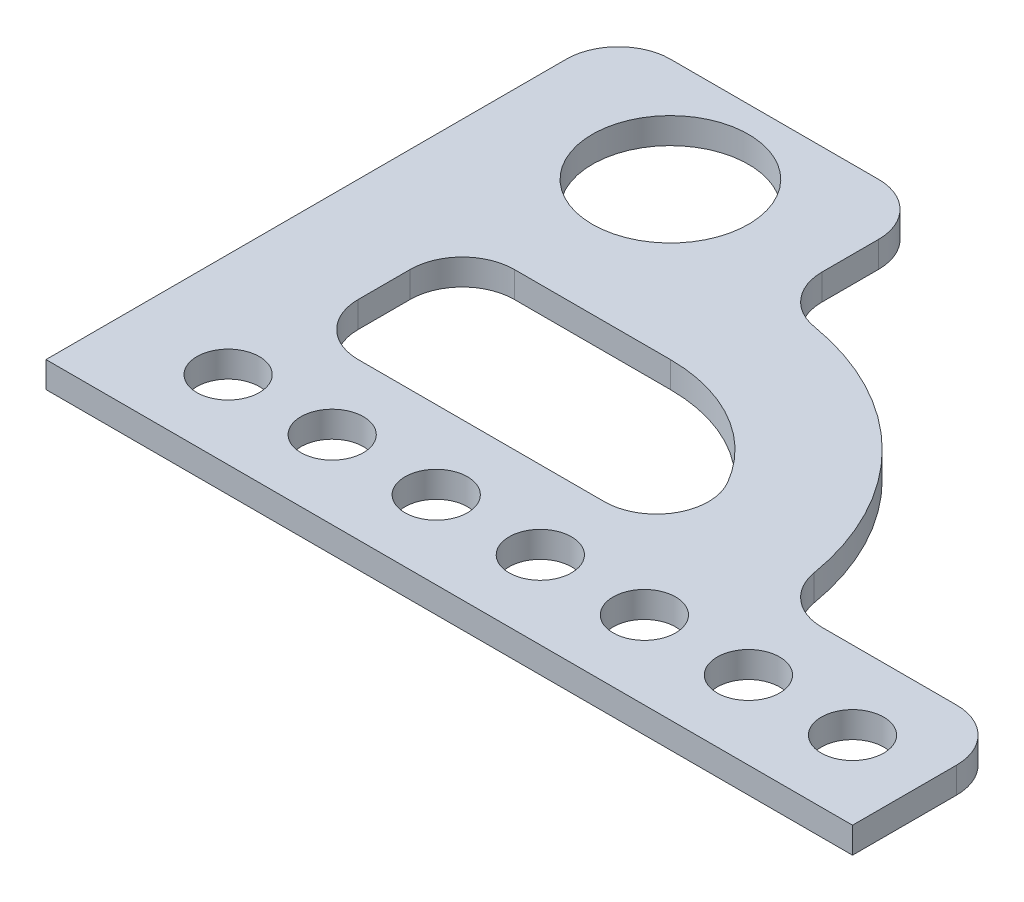
ISO-10303-21;
HEADER;
FILE_DESCRIPTION(('STEP AP214'),'2;1');
FILE_NAME('part.step','',(''),(''),'','','');
FILE_SCHEMA(('AUTOMOTIVE_DESIGN { 1 0 10303 214 1 1 1 1 }'));
ENDSEC;
DATA;
#1=APPLICATION_CONTEXT('core data for automotive mechanical design processes');
#2=APPLICATION_PROTOCOL_DEFINITION('international standard','automotive_design',2000,#1);
#3=PRODUCT_CONTEXT('',#1,'mechanical');
#4=PRODUCT('Part','Part','',(#3));
#5=PRODUCT_RELATED_PRODUCT_CATEGORY('part','',(#4));
#6=PRODUCT_DEFINITION_FORMATION('','',#4);
#7=PRODUCT_DEFINITION_CONTEXT('part definition',#1,'design');
#8=PRODUCT_DEFINITION('design','',#6,#7);
#9=PRODUCT_DEFINITION_SHAPE('','',#8);
#10=(LENGTH_UNIT() NAMED_UNIT(*) SI_UNIT(.MILLI.,.METRE.));
#11=(NAMED_UNIT(*) PLANE_ANGLE_UNIT() SI_UNIT($,.RADIAN.));
#12=(NAMED_UNIT(*) SI_UNIT($,.STERADIAN.) SOLID_ANGLE_UNIT());
#13=UNCERTAINTY_MEASURE_WITH_UNIT(LENGTH_MEASURE(1.E-05),#10,'distance_accuracy_value','');
#14=(GEOMETRIC_REPRESENTATION_CONTEXT(3) GLOBAL_UNCERTAINTY_ASSIGNED_CONTEXT((#13)) GLOBAL_UNIT_ASSIGNED_CONTEXT((#10,
#11,#12)) REPRESENTATION_CONTEXT('',''));
#15=CARTESIAN_POINT('',(0.,0.,0.));
#16=DIRECTION('',(0.,0.,1.));
#17=DIRECTION('',(1.,0.,0.));
#18=AXIS2_PLACEMENT_3D('',#15,#16,#17);
#19=CARTESIAN_POINT('',(10.,5.,-100.));
#20=DIRECTION('',(0.,1.,0.));
#21=DIRECTION('',(0.,0.,1.));
#22=AXIS2_PLACEMENT_3D('',#19,#20,#21);
#23=PLANE('',#22);
#24=CARTESIAN_POINT('',(140.,5.,-15.));
#25=DIRECTION('',(0.,1.,0.));
#26=DIRECTION('',(0.,0.,1.));
#27=AXIS2_PLACEMENT_3D('',#24,#25,#26);
#28=CIRCLE('',#27,6.00000000000002);
#29=CARTESIAN_POINT('',(140.,5.,-8.99999999999998));
#30=VERTEX_POINT('',#29);
#31=EDGE_CURVE('E258',#30,#30,#28,.T.);
#32=ORIENTED_EDGE('',*,*,#31,.F.);
#33=EDGE_LOOP('',(#32));
#34=FACE_BOUND('',#33,.T.);
#35=CARTESIAN_POINT('',(100.,5.,-15.));
#36=DIRECTION('',(0.,1.,0.));
#37=DIRECTION('',(0.,0.,1.));
#38=AXIS2_PLACEMENT_3D('',#35,#36,#37);
#39=CIRCLE('',#38,6.);
#40=CARTESIAN_POINT('',(100.,5.,-9.));
#41=VERTEX_POINT('',#40);
#42=EDGE_CURVE('E274',#41,#41,#39,.T.);
#43=ORIENTED_EDGE('',*,*,#42,.F.);
#44=EDGE_LOOP('',(#43));
#45=FACE_BOUND('',#44,.T.);
#46=CARTESIAN_POINT('',(60.,5.,-15.));
#47=DIRECTION('',(0.,1.,0.));
#48=DIRECTION('',(0.,0.,1.));
#49=AXIS2_PLACEMENT_3D('',#46,#47,#48);
#50=CIRCLE('',#49,5.99999999999999);
#51=CARTESIAN_POINT('',(60.,5.,-9.00000000000001));
#52=VERTEX_POINT('',#51);
#53=EDGE_CURVE('E290',#52,#52,#50,.T.);
#54=ORIENTED_EDGE('',*,*,#53,.F.);
#55=EDGE_LOOP('',(#54));
#56=FACE_BOUND('',#55,.T.);
#57=CARTESIAN_POINT('',(20.,5.,-15.));
#58=DIRECTION('',(0.,1.,0.));
#59=DIRECTION('',(0.,0.,1.));
#60=AXIS2_PLACEMENT_3D('',#57,#58,#59);
#61=CIRCLE('',#60,6.);
#62=CARTESIAN_POINT('',(20.,5.,-9.));
#63=VERTEX_POINT('',#62);
#64=EDGE_CURVE('E306',#63,#63,#61,.T.);
#65=ORIENTED_EDGE('',*,*,#64,.F.);
#66=EDGE_LOOP('',(#65));
#67=FACE_BOUND('',#66,.T.);
#68=DIRECTION('',(0.,0.,1.));
#69=VECTOR('',#68,1.);
#70=CARTESIAN_POINT('',(0.,5.,0.));
#71=LINE('',#70,#69);
#72=CARTESIAN_POINT('',(0.,5.,-99.9999999999999));
#73=VERTEX_POINT('',#72);
#74=CARTESIAN_POINT('',(0.,5.,0.));
#75=VERTEX_POINT('',#74);
#76=EDGE_CURVE('E314',#73,#75,#71,.T.);
#77=ORIENTED_EDGE('',*,*,#76,.T.);
#78=DIRECTION('',(1.,0.,0.));
#79=VECTOR('',#78,1.);
#80=CARTESIAN_POINT('',(0.,5.,0.));
#81=LINE('',#80,#79);
#82=CARTESIAN_POINT('',(155.,5.,0.));
#83=VERTEX_POINT('',#82);
#84=EDGE_CURVE('E318',#75,#83,#81,.T.);
#85=ORIENTED_EDGE('',*,*,#84,.T.);
#86=DIRECTION('',(0.,0.,-1.));
#87=VECTOR('',#86,1.);
#88=CARTESIAN_POINT('',(155.,5.,0.));
#89=LINE('',#88,#87);
#90=CARTESIAN_POINT('',(155.,5.,-19.9999999999999));
#91=VERTEX_POINT('',#90);
#92=EDGE_CURVE('E322',#83,#91,#89,.T.);
#93=ORIENTED_EDGE('',*,*,#92,.T.);
#94=CARTESIAN_POINT('',(145.,5.,-20.));
#95=DIRECTION('',(0.,1.,0.));
#96=DIRECTION('',(0.,0.,1.));
#97=AXIS2_PLACEMENT_3D('',#94,#95,#96);
#98=CIRCLE('',#97,10.);
#99=CARTESIAN_POINT('',(145.,5.,-30.));
#100=VERTEX_POINT('',#99);
#101=EDGE_CURVE('E325',#91,#100,#98,.T.);
#102=ORIENTED_EDGE('',*,*,#101,.T.);
#103=DIRECTION('',(-1.,0.,0.));
#104=VECTOR('',#103,1.);
#105=CARTESIAN_POINT('',(145.,5.,-30.));
#106=LINE('',#105,#104);
#107=CARTESIAN_POINT('',(119.160797830996,5.,-30.));
#108=VERTEX_POINT('',#107);
#109=EDGE_CURVE('E328',#100,#108,#106,.T.);
#110=ORIENTED_EDGE('',*,*,#109,.T.);
#111=CARTESIAN_POINT('',(119.160797830996,5.,-40.));
#112=DIRECTION('',(0.,-1.,0.));
#113=DIRECTION('',(0.,0.,-1.));
#114=AXIS2_PLACEMENT_3D('',#111,#112,#113);
#115=CIRCLE('',#114,10.);
#116=CARTESIAN_POINT('',(109.300664859163,5.,-38.3333333333333));
#117=VERTEX_POINT('',#116);
#118=EDGE_CURVE('E331',#108,#117,#115,.T.);
#119=ORIENTED_EDGE('',*,*,#118,.T.);
#120=CARTESIAN_POINT('',(60.,5.,-30.));
#121=DIRECTION('',(0.,1.,0.));
#122=DIRECTION('',(0.,0.,1.));
#123=AXIS2_PLACEMENT_3D('',#120,#121,#122);
#124=CIRCLE('',#123,50.);
#125=CARTESIAN_POINT('',(68.3333333333333,5.,-79.3006648591635));
#126=VERTEX_POINT('',#125);
#127=EDGE_CURVE('E334',#117,#126,#124,.T.);
#128=ORIENTED_EDGE('',*,*,#127,.T.);
#129=CARTESIAN_POINT('',(70.,5.,-89.1607978309962));
#130=DIRECTION('',(0.,-1.,0.));
#131=DIRECTION('',(0.,0.,-1.));
#132=AXIS2_PLACEMENT_3D('',#129,#130,#131);
#133=CIRCLE('',#132,10.);
#134=CARTESIAN_POINT('',(60.,5.,-89.1607978309962));
#135=VERTEX_POINT('',#134);
#136=EDGE_CURVE('E337',#126,#135,#133,.T.);
#137=ORIENTED_EDGE('',*,*,#136,.T.);
#138=DIRECTION('',(0.,0.,-1.));
#139=VECTOR('',#138,1.);
#140=CARTESIAN_POINT('',(60.,5.,-99.9999999999999));
#141=LINE('',#140,#139);
#142=CARTESIAN_POINT('',(60.,5.,-99.9999999999999));
#143=VERTEX_POINT('',#142);
#144=EDGE_CURVE('E340',#135,#143,#141,.T.);
#145=ORIENTED_EDGE('',*,*,#144,.T.);
#146=CARTESIAN_POINT('',(50.,5.,-100.));
#147=DIRECTION('',(0.,1.,0.));
#148=DIRECTION('',(0.,0.,1.));
#149=AXIS2_PLACEMENT_3D('',#146,#147,#148);
#150=CIRCLE('',#149,9.99999999999999);
#151=CARTESIAN_POINT('',(49.9999999999999,5.,-110.));
#152=VERTEX_POINT('',#151);
#153=EDGE_CURVE('E343',#143,#152,#150,.T.);
#154=ORIENTED_EDGE('',*,*,#153,.T.);
#155=DIRECTION('',(-1.,0.,0.));
#156=VECTOR('',#155,1.);
#157=CARTESIAN_POINT('',(10.0000000000001,5.,-110.));
#158=LINE('',#157,#156);
#159=CARTESIAN_POINT('',(10.0000000000001,5.,-110.));
#160=VERTEX_POINT('',#159);
#161=EDGE_CURVE('E346',#152,#160,#158,.T.);
#162=ORIENTED_EDGE('',*,*,#161,.T.);
#163=CARTESIAN_POINT('',(10.,5.,-100.));
#164=DIRECTION('',(0.,1.,0.));
#165=DIRECTION('',(0.,0.,1.));
#166=AXIS2_PLACEMENT_3D('',#163,#164,#165);
#167=CIRCLE('',#166,10.);
#168=EDGE_CURVE('E349',#160,#73,#167,.T.);
#169=ORIENTED_EDGE('',*,*,#168,.T.);
#170=EDGE_LOOP('',(#77,#85,#93,#102,#110,#119,#128,#137,#145,#154,#162,#169));
#171=FACE_BOUND('',#170,.T.);
#172=CARTESIAN_POINT('',(40.,5.,-15.));
#173=DIRECTION('',(0.,1.,0.));
#174=DIRECTION('',(0.,0.,1.));
#175=AXIS2_PLACEMENT_3D('',#172,#173,#174);
#176=CIRCLE('',#175,6.);
#177=CARTESIAN_POINT('',(40.,5.,-9.));
#178=VERTEX_POINT('',#177);
#179=EDGE_CURVE('E298',#178,#178,#176,.T.);
#180=ORIENTED_EDGE('',*,*,#179,.F.);
#181=EDGE_LOOP('',(#180));
#182=FACE_BOUND('',#181,.T.);
#183=CARTESIAN_POINT('',(80.,5.,-15.));
#184=DIRECTION('',(0.,1.,0.));
#185=DIRECTION('',(0.,0.,1.));
#186=AXIS2_PLACEMENT_3D('',#183,#184,#185);
#187=CIRCLE('',#186,6.);
#188=CARTESIAN_POINT('',(80.,5.,-9.));
#189=VERTEX_POINT('',#188);
#190=EDGE_CURVE('E282',#189,#189,#187,.T.);
#191=ORIENTED_EDGE('',*,*,#190,.F.);
#192=EDGE_LOOP('',(#191));
#193=FACE_BOUND('',#192,.T.);
#194=CARTESIAN_POINT('',(120.,5.,-15.));
#195=DIRECTION('',(0.,1.,0.));
#196=DIRECTION('',(0.,0.,1.));
#197=AXIS2_PLACEMENT_3D('',#194,#195,#196);
#198=CIRCLE('',#197,6.00000000000002);
#199=CARTESIAN_POINT('',(120.,5.,-8.99999999999998));
#200=VERTEX_POINT('',#199);
#201=EDGE_CURVE('E266',#200,#200,#198,.T.);
#202=ORIENTED_EDGE('',*,*,#201,.F.);
#203=EDGE_LOOP('',(#202));
#204=FACE_BOUND('',#203,.T.);
#205=CARTESIAN_POINT('',(30.,5.,-90.));
#206=DIRECTION('',(0.,1.,0.));
#207=DIRECTION('',(0.,0.,1.));
#208=AXIS2_PLACEMENT_3D('',#205,#206,#207);
#209=CIRCLE('',#208,15.);
#210=CARTESIAN_POINT('',(30.,5.,-75.));
#211=VERTEX_POINT('',#210);
#212=EDGE_CURVE('E250',#211,#211,#209,.T.);
#213=ORIENTED_EDGE('',*,*,#212,.F.);
#214=EDGE_LOOP('',(#213));
#215=FACE_BOUND('',#214,.T.);
#216=DIRECTION('',(0.,0.,1.));
#217=VECTOR('',#216,1.);
#218=CARTESIAN_POINT('',(20.,5.,-50.));
#219=LINE('',#218,#217);
#220=CARTESIAN_POINT('',(20.,5.,-50.));
#221=VERTEX_POINT('',#220);
#222=CARTESIAN_POINT('',(20.,5.,-40.));
#223=VERTEX_POINT('',#222);
#224=EDGE_CURVE('E180',#221,#223,#219,.T.);
#225=ORIENTED_EDGE('',*,*,#224,.F.);
#226=CARTESIAN_POINT('',(30.,5.,-50.));
#227=DIRECTION('',(0.,1.,0.));
#228=DIRECTION('',(0.,0.,1.));
#229=AXIS2_PLACEMENT_3D('',#226,#227,#228);
#230=CIRCLE('',#229,10.);
#231=CARTESIAN_POINT('',(30.,5.,-60.));
#232=VERTEX_POINT('',#231);
#233=EDGE_CURVE('E171',#232,#221,#230,.T.);
#234=ORIENTED_EDGE('',*,*,#233,.F.);
#235=DIRECTION('',(-1.,0.,0.));
#236=VECTOR('',#235,1.);
#237=CARTESIAN_POINT('',(60.,5.,-60.));
#238=LINE('',#237,#236);
#239=CARTESIAN_POINT('',(60.,5.,-60.));
#240=VERTEX_POINT('',#239);
#241=EDGE_CURVE('E209',#240,#232,#238,.T.);
#242=ORIENTED_EDGE('',*,*,#241,.F.);
#243=CARTESIAN_POINT('',(60.,5.,-30.));
#244=DIRECTION('',(0.,1.,0.));
#245=DIRECTION('',(0.,0.,1.));
#246=AXIS2_PLACEMENT_3D('',#243,#244,#245);
#247=CIRCLE('',#246,30.);
#248=CARTESIAN_POINT('',(85.9807621135332,5.,-45.));
#249=VERTEX_POINT('',#248);
#250=EDGE_CURVE('E206',#249,#240,#247,.T.);
#251=ORIENTED_EDGE('',*,*,#250,.F.);
#252=CARTESIAN_POINT('',(77.3205080756888,5.,-40.));
#253=DIRECTION('',(0.,1.,0.));
#254=DIRECTION('',(0.,0.,1.));
#255=AXIS2_PLACEMENT_3D('',#252,#253,#254);
#256=CIRCLE('',#255,10.);
#257=CARTESIAN_POINT('',(77.3205080756888,5.,-30.));
#258=VERTEX_POINT('',#257);
#259=EDGE_CURVE('E203',#258,#249,#256,.T.);
#260=ORIENTED_EDGE('',*,*,#259,.F.);
#261=DIRECTION('',(1.,0.,0.));
#262=VECTOR('',#261,1.);
#263=CARTESIAN_POINT('',(30.,5.,-30.));
#264=LINE('',#263,#262);
#265=CARTESIAN_POINT('',(30.,5.,-30.));
#266=VERTEX_POINT('',#265);
#267=EDGE_CURVE('E198',#266,#258,#264,.T.);
#268=ORIENTED_EDGE('',*,*,#267,.F.);
#269=CARTESIAN_POINT('',(30.,5.,-40.));
#270=DIRECTION('',(0.,1.,0.));
#271=DIRECTION('',(0.,0.,-1.));
#272=AXIS2_PLACEMENT_3D('',#269,#270,#271);
#273=CIRCLE('',#272,10.);
#274=EDGE_CURVE('E194',#223,#266,#273,.T.);
#275=ORIENTED_EDGE('',*,*,#274,.F.);
#276=EDGE_LOOP('',(#225,#234,#242,#251,#260,#268,#275));
#277=FACE_BOUND('',#276,.T.);
#278=ADVANCED_FACE('F39',(#34,#45,#56,#67,#171,#182,#193,#204,#215,#277),#23,.T.);
#279=CARTESIAN_POINT('',(10.,0.,-100.));
#280=DIRECTION('',(0.,1.,0.));
#281=DIRECTION('',(0.,0.,1.));
#282=AXIS2_PLACEMENT_3D('',#279,#280,#281);
#283=PLANE('',#282);
#284=CARTESIAN_POINT('',(30.,0.,-90.));
#285=DIRECTION('',(0.,1.,0.));
#286=DIRECTION('',(0.,0.,1.));
#287=AXIS2_PLACEMENT_3D('',#284,#285,#286);
#288=CIRCLE('',#287,15.);
#289=CARTESIAN_POINT('',(30.,0.,-75.));
#290=VERTEX_POINT('',#289);
#291=EDGE_CURVE('E189',#290,#290,#288,.T.);
#292=ORIENTED_EDGE('',*,*,#291,.T.);
#293=EDGE_LOOP('',(#292));
#294=FACE_BOUND('',#293,.T.);
#295=CARTESIAN_POINT('',(140.,0.,-15.));
#296=DIRECTION('',(0.,1.,0.));
#297=DIRECTION('',(0.,0.,1.));
#298=AXIS2_PLACEMENT_3D('',#295,#296,#297);
#299=CIRCLE('',#298,6.00000000000002);
#300=CARTESIAN_POINT('',(140.,0.,-8.99999999999998));
#301=VERTEX_POINT('',#300);
#302=EDGE_CURVE('E254',#301,#301,#299,.T.);
#303=ORIENTED_EDGE('',*,*,#302,.T.);
#304=EDGE_LOOP('',(#303));
#305=FACE_BOUND('',#304,.T.);
#306=CARTESIAN_POINT('',(120.,0.,-15.));
#307=DIRECTION('',(0.,1.,0.));
#308=DIRECTION('',(0.,0.,1.));
#309=AXIS2_PLACEMENT_3D('',#306,#307,#308);
#310=CIRCLE('',#309,6.00000000000002);
#311=CARTESIAN_POINT('',(120.,0.,-8.99999999999998));
#312=VERTEX_POINT('',#311);
#313=EDGE_CURVE('E262',#312,#312,#310,.T.);
#314=ORIENTED_EDGE('',*,*,#313,.T.);
#315=EDGE_LOOP('',(#314));
#316=FACE_BOUND('',#315,.T.);
#317=CARTESIAN_POINT('',(100.,0.,-15.));
#318=DIRECTION('',(0.,1.,0.));
#319=DIRECTION('',(0.,0.,1.));
#320=AXIS2_PLACEMENT_3D('',#317,#318,#319);
#321=CIRCLE('',#320,6.);
#322=CARTESIAN_POINT('',(100.,0.,-9.));
#323=VERTEX_POINT('',#322);
#324=EDGE_CURVE('E270',#323,#323,#321,.T.);
#325=ORIENTED_EDGE('',*,*,#324,.T.);
#326=EDGE_LOOP('',(#325));
#327=FACE_BOUND('',#326,.T.);
#328=CARTESIAN_POINT('',(80.,0.,-15.));
#329=DIRECTION('',(0.,1.,0.));
#330=DIRECTION('',(0.,0.,1.));
#331=AXIS2_PLACEMENT_3D('',#328,#329,#330);
#332=CIRCLE('',#331,6.);
#333=CARTESIAN_POINT('',(80.,0.,-9.));
#334=VERTEX_POINT('',#333);
#335=EDGE_CURVE('E278',#334,#334,#332,.T.);
#336=ORIENTED_EDGE('',*,*,#335,.T.);
#337=EDGE_LOOP('',(#336));
#338=FACE_BOUND('',#337,.T.);
#339=CARTESIAN_POINT('',(60.,0.,-15.));
#340=DIRECTION('',(0.,1.,0.));
#341=DIRECTION('',(0.,0.,1.));
#342=AXIS2_PLACEMENT_3D('',#339,#340,#341);
#343=CIRCLE('',#342,5.99999999999999);
#344=CARTESIAN_POINT('',(60.,0.,-9.00000000000001));
#345=VERTEX_POINT('',#344);
#346=EDGE_CURVE('E286',#345,#345,#343,.T.);
#347=ORIENTED_EDGE('',*,*,#346,.T.);
#348=EDGE_LOOP('',(#347));
#349=FACE_BOUND('',#348,.T.);
#350=CARTESIAN_POINT('',(40.,0.,-15.));
#351=DIRECTION('',(0.,1.,0.));
#352=DIRECTION('',(0.,0.,1.));
#353=AXIS2_PLACEMENT_3D('',#350,#351,#352);
#354=CIRCLE('',#353,6.);
#355=CARTESIAN_POINT('',(40.,0.,-9.));
#356=VERTEX_POINT('',#355);
#357=EDGE_CURVE('E294',#356,#356,#354,.T.);
#358=ORIENTED_EDGE('',*,*,#357,.T.);
#359=EDGE_LOOP('',(#358));
#360=FACE_BOUND('',#359,.T.);
#361=CARTESIAN_POINT('',(20.,0.,-15.));
#362=DIRECTION('',(0.,1.,0.));
#363=DIRECTION('',(0.,0.,1.));
#364=AXIS2_PLACEMENT_3D('',#361,#362,#363);
#365=CIRCLE('',#364,6.);
#366=CARTESIAN_POINT('',(20.,0.,-9.));
#367=VERTEX_POINT('',#366);
#368=EDGE_CURVE('E302',#367,#367,#365,.T.);
#369=ORIENTED_EDGE('',*,*,#368,.T.);
#370=EDGE_LOOP('',(#369));
#371=FACE_BOUND('',#370,.T.);
#372=DIRECTION('',(0.,0.,1.));
#373=VECTOR('',#372,1.);
#374=CARTESIAN_POINT('',(0.,0.,0.));
#375=LINE('',#374,#373);
#376=CARTESIAN_POINT('',(0.,0.,-99.9999999999999));
#377=VERTEX_POINT('',#376);
#378=CARTESIAN_POINT('',(0.,0.,0.));
#379=VERTEX_POINT('',#378);
#380=EDGE_CURVE('E310',#377,#379,#375,.T.);
#381=ORIENTED_EDGE('',*,*,#380,.F.);
#382=CARTESIAN_POINT('',(10.,0.,-100.));
#383=DIRECTION('',(0.,1.,0.));
#384=DIRECTION('',(0.,0.,1.));
#385=AXIS2_PLACEMENT_3D('',#382,#383,#384);
#386=CIRCLE('',#385,10.);
#387=CARTESIAN_POINT('',(10.0000000000001,0.,-110.));
#388=VERTEX_POINT('',#387);
#389=EDGE_CURVE('E319',#388,#377,#386,.T.);
#390=ORIENTED_EDGE('',*,*,#389,.F.);
#391=DIRECTION('',(-1.,0.,0.));
#392=VECTOR('',#391,1.);
#393=CARTESIAN_POINT('',(10.0000000000001,0.,-110.));
#394=LINE('',#393,#392);
#395=CARTESIAN_POINT('',(49.9999999999999,0.,-110.));
#396=VERTEX_POINT('',#395);
#397=EDGE_CURVE('E383',#396,#388,#394,.T.);
#398=ORIENTED_EDGE('',*,*,#397,.F.);
#399=CARTESIAN_POINT('',(50.,0.,-100.));
#400=DIRECTION('',(0.,1.,0.));
#401=DIRECTION('',(0.,0.,1.));
#402=AXIS2_PLACEMENT_3D('',#399,#400,#401);
#403=CIRCLE('',#402,9.99999999999999);
#404=CARTESIAN_POINT('',(60.,0.,-99.9999999999999));
#405=VERTEX_POINT('',#404);
#406=EDGE_CURVE('E380',#405,#396,#403,.T.);
#407=ORIENTED_EDGE('',*,*,#406,.F.);
#408=DIRECTION('',(0.,0.,-1.));
#409=VECTOR('',#408,1.);
#410=CARTESIAN_POINT('',(60.,0.,-99.9999999999999));
#411=LINE('',#410,#409);
#412=CARTESIAN_POINT('',(60.,0.,-89.1607978309962));
#413=VERTEX_POINT('',#412);
#414=EDGE_CURVE('E377',#413,#405,#411,.T.);
#415=ORIENTED_EDGE('',*,*,#414,.F.);
#416=CARTESIAN_POINT('',(70.,0.,-89.1607978309962));
#417=DIRECTION('',(0.,-1.,0.));
#418=DIRECTION('',(0.,0.,-1.));
#419=AXIS2_PLACEMENT_3D('',#416,#417,#418);
#420=CIRCLE('',#419,10.);
#421=CARTESIAN_POINT('',(68.3333333333333,0.,-79.3006648591635));
#422=VERTEX_POINT('',#421);
#423=EDGE_CURVE('E374',#422,#413,#420,.T.);
#424=ORIENTED_EDGE('',*,*,#423,.F.);
#425=CARTESIAN_POINT('',(60.,0.,-30.));
#426=DIRECTION('',(0.,1.,0.));
#427=DIRECTION('',(0.,0.,1.));
#428=AXIS2_PLACEMENT_3D('',#425,#426,#427);
#429=CIRCLE('',#428,50.);
#430=CARTESIAN_POINT('',(109.300664859163,0.,-38.3333333333333));
#431=VERTEX_POINT('',#430);
#432=EDGE_CURVE('E371',#431,#422,#429,.T.);
#433=ORIENTED_EDGE('',*,*,#432,.F.);
#434=CARTESIAN_POINT('',(119.160797830996,0.,-40.));
#435=DIRECTION('',(0.,-1.,0.));
#436=DIRECTION('',(0.,0.,-1.));
#437=AXIS2_PLACEMENT_3D('',#434,#435,#436);
#438=CIRCLE('',#437,10.);
#439=CARTESIAN_POINT('',(119.160797830996,0.,-30.));
#440=VERTEX_POINT('',#439);
#441=EDGE_CURVE('E368',#440,#431,#438,.T.);
#442=ORIENTED_EDGE('',*,*,#441,.F.);
#443=DIRECTION('',(-1.,0.,0.));
#444=VECTOR('',#443,1.);
#445=CARTESIAN_POINT('',(145.,0.,-30.));
#446=LINE('',#445,#444);
#447=CARTESIAN_POINT('',(145.,0.,-30.));
#448=VERTEX_POINT('',#447);
#449=EDGE_CURVE('E365',#448,#440,#446,.T.);
#450=ORIENTED_EDGE('',*,*,#449,.F.);
#451=CARTESIAN_POINT('',(145.,0.,-20.));
#452=DIRECTION('',(0.,1.,0.));
#453=DIRECTION('',(0.,0.,1.));
#454=AXIS2_PLACEMENT_3D('',#451,#452,#453);
#455=CIRCLE('',#454,10.);
#456=CARTESIAN_POINT('',(155.,0.,-19.9999999999999));
#457=VERTEX_POINT('',#456);
#458=EDGE_CURVE('E362',#457,#448,#455,.T.);
#459=ORIENTED_EDGE('',*,*,#458,.F.);
#460=DIRECTION('',(0.,0.,-1.));
#461=VECTOR('',#460,1.);
#462=CARTESIAN_POINT('',(155.,0.,0.));
#463=LINE('',#462,#461);
#464=CARTESIAN_POINT('',(155.,0.,0.));
#465=VERTEX_POINT('',#464);
#466=EDGE_CURVE('E359',#465,#457,#463,.T.);
#467=ORIENTED_EDGE('',*,*,#466,.F.);
#468=DIRECTION('',(1.,0.,0.));
#469=VECTOR('',#468,1.);
#470=CARTESIAN_POINT('',(0.,0.,0.));
#471=LINE('',#470,#469);
#472=EDGE_CURVE('E356',#379,#465,#471,.T.);
#473=ORIENTED_EDGE('',*,*,#472,.F.);
#474=EDGE_LOOP('',(#381,#390,#398,#407,#415,#424,#433,#442,#450,#459,#467,#473));
#475=FACE_BOUND('',#474,.T.);
#476=CARTESIAN_POINT('',(30.,0.,-50.));
#477=DIRECTION('',(0.,1.,0.));
#478=DIRECTION('',(0.,0.,1.));
#479=AXIS2_PLACEMENT_3D('',#476,#477,#478);
#480=CIRCLE('',#479,10.);
#481=CARTESIAN_POINT('',(30.,0.,-60.));
#482=VERTEX_POINT('',#481);
#483=CARTESIAN_POINT('',(20.,0.,-50.));
#484=VERTEX_POINT('',#483);
#485=EDGE_CURVE('E63',#482,#484,#480,.T.);
#486=ORIENTED_EDGE('',*,*,#485,.T.);
#487=DIRECTION('',(0.,0.,1.));
#488=VECTOR('',#487,1.);
#489=CARTESIAN_POINT('',(20.,0.,-50.));
#490=LINE('',#489,#488);
#491=CARTESIAN_POINT('',(20.,0.,-40.));
#492=VERTEX_POINT('',#491);
#493=EDGE_CURVE('E187',#484,#492,#490,.T.);
#494=ORIENTED_EDGE('',*,*,#493,.T.);
#495=CARTESIAN_POINT('',(30.,0.,-40.));
#496=DIRECTION('',(0.,1.,0.));
#497=DIRECTION('',(0.,0.,-1.));
#498=AXIS2_PLACEMENT_3D('',#495,#496,#497);
#499=CIRCLE('',#498,10.);
#500=CARTESIAN_POINT('',(30.,0.,-30.));
#501=VERTEX_POINT('',#500);
#502=EDGE_CURVE('E216',#492,#501,#499,.T.);
#503=ORIENTED_EDGE('',*,*,#502,.T.);
#504=DIRECTION('',(1.,0.,0.));
#505=VECTOR('',#504,1.);
#506=CARTESIAN_POINT('',(30.,0.,-30.));
#507=LINE('',#506,#505);
#508=CARTESIAN_POINT('',(77.3205080756888,0.,-30.));
#509=VERTEX_POINT('',#508);
#510=EDGE_CURVE('E220',#501,#509,#507,.T.);
#511=ORIENTED_EDGE('',*,*,#510,.T.);
#512=CARTESIAN_POINT('',(77.3205080756888,0.,-40.));
#513=DIRECTION('',(0.,1.,0.));
#514=DIRECTION('',(0.,0.,1.));
#515=AXIS2_PLACEMENT_3D('',#512,#513,#514);
#516=CIRCLE('',#515,10.);
#517=CARTESIAN_POINT('',(85.9807621135332,0.,-45.));
#518=VERTEX_POINT('',#517);
#519=EDGE_CURVE('E224',#509,#518,#516,.T.);
#520=ORIENTED_EDGE('',*,*,#519,.T.);
#521=CARTESIAN_POINT('',(60.,0.,-30.));
#522=DIRECTION('',(0.,1.,0.));
#523=DIRECTION('',(0.,0.,1.));
#524=AXIS2_PLACEMENT_3D('',#521,#522,#523);
#525=CIRCLE('',#524,30.);
#526=CARTESIAN_POINT('',(60.,0.,-60.));
#527=VERTEX_POINT('',#526);
#528=EDGE_CURVE('E228',#518,#527,#525,.T.);
#529=ORIENTED_EDGE('',*,*,#528,.T.);
#530=DIRECTION('',(-1.,0.,0.));
#531=VECTOR('',#530,1.);
#532=CARTESIAN_POINT('',(60.,0.,-60.));
#533=LINE('',#532,#531);
#534=EDGE_CURVE('E181',#527,#482,#533,.T.);
#535=ORIENTED_EDGE('',*,*,#534,.T.);
#536=EDGE_LOOP('',(#486,#494,#503,#511,#520,#529,#535));
#537=FACE_BOUND('',#536,.T.);
#538=ADVANCED_FACE('F438',(#294,#305,#316,#327,#338,#349,#360,#371,#475,#537),#283,.F.);
#539=CARTESIAN_POINT('',(0.,5.,0.));
#540=DIRECTION('',(1.,0.,0.));
#541=DIRECTION('',(0.,0.,-1.));
#542=AXIS2_PLACEMENT_3D('',#539,#540,#541);
#543=PLANE('',#542);
#544=ORIENTED_EDGE('',*,*,#380,.T.);
#545=DIRECTION('',(0.,-1.,0.));
#546=VECTOR('',#545,1.);
#547=CARTESIAN_POINT('',(0.,5.,0.));
#548=LINE('',#547,#546);
#549=EDGE_CURVE('E11',#75,#379,#548,.T.);
#550=ORIENTED_EDGE('',*,*,#549,.F.);
#551=ORIENTED_EDGE('',*,*,#76,.F.);
#552=DIRECTION('',(0.,-1.,0.));
#553=VECTOR('',#552,1.);
#554=CARTESIAN_POINT('',(0.,5.,-99.9999999999999));
#555=LINE('',#554,#553);
#556=EDGE_CURVE('E352',#73,#377,#555,.T.);
#557=ORIENTED_EDGE('',*,*,#556,.T.);
#558=EDGE_LOOP('',(#544,#550,#551,#557));
#559=FACE_BOUND('',#558,.T.);
#560=ADVANCED_FACE('F41',(#559),#543,.F.);
#561=CARTESIAN_POINT('',(0.,5.,0.));
#562=DIRECTION('',(0.,0.,-1.));
#563=DIRECTION('',(-1.,0.,0.));
#564=AXIS2_PLACEMENT_3D('',#561,#562,#563);
#565=PLANE('',#564);
#566=ORIENTED_EDGE('',*,*,#472,.T.);
#567=DIRECTION('',(0.,-1.,0.));
#568=VECTOR('',#567,1.);
#569=CARTESIAN_POINT('',(155.,5.,0.));
#570=LINE('',#569,#568);
#571=EDGE_CURVE('E48',#83,#465,#570,.T.);
#572=ORIENTED_EDGE('',*,*,#571,.F.);
#573=ORIENTED_EDGE('',*,*,#84,.F.);
#574=ORIENTED_EDGE('',*,*,#549,.T.);
#575=EDGE_LOOP('',(#566,#572,#573,#574));
#576=FACE_BOUND('',#575,.T.);
#577=ADVANCED_FACE('F456',(#576),#565,.F.);
#578=CARTESIAN_POINT('',(155.,5.,0.));
#579=DIRECTION('',(-1.,0.,0.));
#580=DIRECTION('',(0.,0.,1.));
#581=AXIS2_PLACEMENT_3D('',#578,#579,#580);
#582=PLANE('',#581);
#583=ORIENTED_EDGE('',*,*,#466,.T.);
#584=DIRECTION('',(0.,-1.,0.));
#585=VECTOR('',#584,1.);
#586=CARTESIAN_POINT('',(155.,5.,-19.9999999999999));
#587=LINE('',#586,#585);
#588=EDGE_CURVE('E423',#91,#457,#587,.T.);
#589=ORIENTED_EDGE('',*,*,#588,.F.);
#590=ORIENTED_EDGE('',*,*,#92,.F.);
#591=ORIENTED_EDGE('',*,*,#571,.T.);
#592=EDGE_LOOP('',(#583,#589,#590,#591));
#593=FACE_BOUND('',#592,.T.);
#594=ADVANCED_FACE('F432',(#593),#582,.F.);
#595=CARTESIAN_POINT('',(145.,5.,-20.));
#596=DIRECTION('',(0.,-1.,0.));
#597=DIRECTION('',(0.,0.,-1.));
#598=AXIS2_PLACEMENT_3D('',#595,#596,#597);
#599=CYLINDRICAL_SURFACE('',#598,10.);
#600=ORIENTED_EDGE('',*,*,#458,.T.);
#601=DIRECTION('',(0.,-1.,0.));
#602=VECTOR('',#601,1.);
#603=CARTESIAN_POINT('',(145.,5.,-30.));
#604=LINE('',#603,#602);
#605=EDGE_CURVE('E419',#100,#448,#604,.T.);
#606=ORIENTED_EDGE('',*,*,#605,.F.);
#607=ORIENTED_EDGE('',*,*,#101,.F.);
#608=ORIENTED_EDGE('',*,*,#588,.T.);
#609=EDGE_LOOP('',(#600,#606,#607,#608));
#610=FACE_BOUND('',#609,.T.);
#611=ADVANCED_FACE('F444',(#610),#599,.T.);
#612=CARTESIAN_POINT('',(145.,5.,-30.));
#613=DIRECTION('',(0.,0.,1.));
#614=DIRECTION('',(1.,0.,0.));
#615=AXIS2_PLACEMENT_3D('',#612,#613,#614);
#616=PLANE('',#615);
#617=ORIENTED_EDGE('',*,*,#449,.T.);
#618=DIRECTION('',(0.,-1.,0.));
#619=VECTOR('',#618,1.);
#620=CARTESIAN_POINT('',(119.160797830996,5.,-30.));
#621=LINE('',#620,#619);
#622=EDGE_CURVE('E415',#108,#440,#621,.T.);
#623=ORIENTED_EDGE('',*,*,#622,.F.);
#624=ORIENTED_EDGE('',*,*,#109,.F.);
#625=ORIENTED_EDGE('',*,*,#605,.T.);
#626=EDGE_LOOP('',(#617,#623,#624,#625));
#627=FACE_BOUND('',#626,.T.);
#628=ADVANCED_FACE('F448',(#627),#616,.F.);
#629=CARTESIAN_POINT('',(119.160797830996,5.,-40.));
#630=DIRECTION('',(0.,-1.,0.));
#631=DIRECTION('',(0.,0.,-1.));
#632=AXIS2_PLACEMENT_3D('',#629,#630,#631);
#633=CYLINDRICAL_SURFACE('',#632,10.);
#634=ORIENTED_EDGE('',*,*,#441,.T.);
#635=DIRECTION('',(0.,-1.,0.));
#636=VECTOR('',#635,1.);
#637=CARTESIAN_POINT('',(109.300664859163,5.,-38.3333333333333));
#638=LINE('',#637,#636);
#639=EDGE_CURVE('E411',#117,#431,#638,.T.);
#640=ORIENTED_EDGE('',*,*,#639,.F.);
#641=ORIENTED_EDGE('',*,*,#118,.F.);
#642=ORIENTED_EDGE('',*,*,#622,.T.);
#643=EDGE_LOOP('',(#634,#640,#641,#642));
#644=FACE_BOUND('',#643,.T.);
#645=ADVANCED_FACE('F489',(#644),#633,.F.);
#646=CARTESIAN_POINT('',(60.,5.,-30.));
#647=DIRECTION('',(0.,-1.,0.));
#648=DIRECTION('',(0.,0.,-1.));
#649=AXIS2_PLACEMENT_3D('',#646,#647,#648);
#650=CYLINDRICAL_SURFACE('',#649,50.);
#651=ORIENTED_EDGE('',*,*,#432,.T.);
#652=DIRECTION('',(0.,-1.,0.));
#653=VECTOR('',#652,1.);
#654=CARTESIAN_POINT('',(68.3333333333333,5.,-79.3006648591635));
#655=LINE('',#654,#653);
#656=EDGE_CURVE('E407',#126,#422,#655,.T.);
#657=ORIENTED_EDGE('',*,*,#656,.F.);
#658=ORIENTED_EDGE('',*,*,#127,.F.);
#659=ORIENTED_EDGE('',*,*,#639,.T.);
#660=EDGE_LOOP('',(#651,#657,#658,#659));
#661=FACE_BOUND('',#660,.T.);
#662=ADVANCED_FACE('F487',(#661),#650,.T.);
#663=CARTESIAN_POINT('',(70.,5.,-89.1607978309962));
#664=DIRECTION('',(0.,-1.,0.));
#665=DIRECTION('',(0.,0.,-1.));
#666=AXIS2_PLACEMENT_3D('',#663,#664,#665);
#667=CYLINDRICAL_SURFACE('',#666,10.);
#668=ORIENTED_EDGE('',*,*,#423,.T.);
#669=DIRECTION('',(0.,-1.,0.));
#670=VECTOR('',#669,1.);
#671=CARTESIAN_POINT('',(60.,5.,-89.1607978309962));
#672=LINE('',#671,#670);
#673=EDGE_CURVE('E403',#135,#413,#672,.T.);
#674=ORIENTED_EDGE('',*,*,#673,.F.);
#675=ORIENTED_EDGE('',*,*,#136,.F.);
#676=ORIENTED_EDGE('',*,*,#656,.T.);
#677=EDGE_LOOP('',(#668,#674,#675,#676));
#678=FACE_BOUND('',#677,.T.);
#679=ADVANCED_FACE('F483',(#678),#667,.F.);
#680=CARTESIAN_POINT('',(60.,5.,-99.9999999999999));
#681=DIRECTION('',(-1.,0.,0.));
#682=DIRECTION('',(0.,0.,1.));
#683=AXIS2_PLACEMENT_3D('',#680,#681,#682);
#684=PLANE('',#683);
#685=ORIENTED_EDGE('',*,*,#414,.T.);
#686=DIRECTION('',(0.,-1.,0.));
#687=VECTOR('',#686,1.);
#688=CARTESIAN_POINT('',(60.,5.,-99.9999999999999));
#689=LINE('',#688,#687);
#690=EDGE_CURVE('E399',#143,#405,#689,.T.);
#691=ORIENTED_EDGE('',*,*,#690,.F.);
#692=ORIENTED_EDGE('',*,*,#144,.F.);
#693=ORIENTED_EDGE('',*,*,#673,.T.);
#694=EDGE_LOOP('',(#685,#691,#692,#693));
#695=FACE_BOUND('',#694,.T.);
#696=ADVANCED_FACE('F478',(#695),#684,.F.);
#697=CARTESIAN_POINT('',(50.,5.,-100.));
#698=DIRECTION('',(0.,-1.,0.));
#699=DIRECTION('',(0.,0.,-1.));
#700=AXIS2_PLACEMENT_3D('',#697,#698,#699);
#701=CYLINDRICAL_SURFACE('',#700,9.99999999999999);
#702=ORIENTED_EDGE('',*,*,#406,.T.);
#703=DIRECTION('',(0.,-1.,0.));
#704=VECTOR('',#703,1.);
#705=CARTESIAN_POINT('',(49.9999999999999,5.,-110.));
#706=LINE('',#705,#704);
#707=EDGE_CURVE('E395',#152,#396,#706,.T.);
#708=ORIENTED_EDGE('',*,*,#707,.F.);
#709=ORIENTED_EDGE('',*,*,#153,.F.);
#710=ORIENTED_EDGE('',*,*,#690,.T.);
#711=EDGE_LOOP('',(#702,#708,#709,#710));
#712=FACE_BOUND('',#711,.T.);
#713=ADVANCED_FACE('F472',(#712),#701,.T.);
#714=CARTESIAN_POINT('',(10.0000000000001,5.,-110.));
#715=DIRECTION('',(0.,0.,1.));
#716=DIRECTION('',(1.,0.,0.));
#717=AXIS2_PLACEMENT_3D('',#714,#715,#716);
#718=PLANE('',#717);
#719=ORIENTED_EDGE('',*,*,#397,.T.);
#720=DIRECTION('',(0.,-1.,0.));
#721=VECTOR('',#720,1.);
#722=CARTESIAN_POINT('',(10.0000000000001,5.,-110.));
#723=LINE('',#722,#721);
#724=EDGE_CURVE('E391',#160,#388,#723,.T.);
#725=ORIENTED_EDGE('',*,*,#724,.F.);
#726=ORIENTED_EDGE('',*,*,#161,.F.);
#727=ORIENTED_EDGE('',*,*,#707,.T.);
#728=EDGE_LOOP('',(#719,#725,#726,#727));
#729=FACE_BOUND('',#728,.T.);
#730=ADVANCED_FACE('F468',(#729),#718,.F.);
#731=CARTESIAN_POINT('',(10.,5.,-100.));
#732=DIRECTION('',(0.,-1.,0.));
#733=DIRECTION('',(0.,0.,-1.));
#734=AXIS2_PLACEMENT_3D('',#731,#732,#733);
#735=CYLINDRICAL_SURFACE('',#734,10.);
#736=ORIENTED_EDGE('',*,*,#389,.T.);
#737=ORIENTED_EDGE('',*,*,#556,.F.);
#738=ORIENTED_EDGE('',*,*,#168,.F.);
#739=ORIENTED_EDGE('',*,*,#724,.T.);
#740=EDGE_LOOP('',(#736,#737,#738,#739));
#741=FACE_BOUND('',#740,.T.);
#742=ADVANCED_FACE('F463',(#741),#735,.T.);
#743=CARTESIAN_POINT('',(20.,5.,-15.));
#744=DIRECTION('',(0.,-1.,0.));
#745=DIRECTION('',(0.,0.,-1.));
#746=AXIS2_PLACEMENT_3D('',#743,#744,#745);
#747=CYLINDRICAL_SURFACE('',#746,6.);
#748=ORIENTED_EDGE('',*,*,#64,.T.);
#749=EDGE_LOOP('',(#748));
#750=FACE_BOUND('',#749,.T.);
#751=ORIENTED_EDGE('',*,*,#368,.F.);
#752=EDGE_LOOP('',(#751));
#753=FACE_BOUND('',#752,.T.);
#754=ADVANCED_FACE('F509',(#750,#753),#747,.F.);
#755=CARTESIAN_POINT('',(40.,5.,-15.));
#756=DIRECTION('',(0.,-1.,0.));
#757=DIRECTION('',(0.,0.,-1.));
#758=AXIS2_PLACEMENT_3D('',#755,#756,#757);
#759=CYLINDRICAL_SURFACE('',#758,6.);
#760=ORIENTED_EDGE('',*,*,#179,.T.);
#761=EDGE_LOOP('',(#760));
#762=FACE_BOUND('',#761,.T.);
#763=ORIENTED_EDGE('',*,*,#357,.F.);
#764=EDGE_LOOP('',(#763));
#765=FACE_BOUND('',#764,.T.);
#766=ADVANCED_FACE('F547',(#762,#765),#759,.F.);
#767=CARTESIAN_POINT('',(60.,5.,-15.));
#768=DIRECTION('',(0.,-1.,0.));
#769=DIRECTION('',(0.,0.,-1.));
#770=AXIS2_PLACEMENT_3D('',#767,#768,#769);
#771=CYLINDRICAL_SURFACE('',#770,5.99999999999999);
#772=ORIENTED_EDGE('',*,*,#53,.T.);
#773=EDGE_LOOP('',(#772));
#774=FACE_BOUND('',#773,.T.);
#775=ORIENTED_EDGE('',*,*,#346,.F.);
#776=EDGE_LOOP('',(#775));
#777=FACE_BOUND('',#776,.T.);
#778=ADVANCED_FACE('F554',(#774,#777),#771,.F.);
#779=CARTESIAN_POINT('',(80.,5.,-15.));
#780=DIRECTION('',(0.,-1.,0.));
#781=DIRECTION('',(0.,0.,-1.));
#782=AXIS2_PLACEMENT_3D('',#779,#780,#781);
#783=CYLINDRICAL_SURFACE('',#782,6.);
#784=ORIENTED_EDGE('',*,*,#190,.T.);
#785=EDGE_LOOP('',(#784));
#786=FACE_BOUND('',#785,.T.);
#787=ORIENTED_EDGE('',*,*,#335,.F.);
#788=EDGE_LOOP('',(#787));
#789=FACE_BOUND('',#788,.T.);
#790=ADVANCED_FACE('F561',(#786,#789),#783,.F.);
#791=CARTESIAN_POINT('',(100.,5.,-15.));
#792=DIRECTION('',(0.,-1.,0.));
#793=DIRECTION('',(0.,0.,-1.));
#794=AXIS2_PLACEMENT_3D('',#791,#792,#793);
#795=CYLINDRICAL_SURFACE('',#794,6.);
#796=ORIENTED_EDGE('',*,*,#42,.T.);
#797=EDGE_LOOP('',(#796));
#798=FACE_BOUND('',#797,.T.);
#799=ORIENTED_EDGE('',*,*,#324,.F.);
#800=EDGE_LOOP('',(#799));
#801=FACE_BOUND('',#800,.T.);
#802=ADVANCED_FACE('F569',(#798,#801),#795,.F.);
#803=CARTESIAN_POINT('',(120.,5.,-15.));
#804=DIRECTION('',(0.,-1.,0.));
#805=DIRECTION('',(0.,0.,-1.));
#806=AXIS2_PLACEMENT_3D('',#803,#804,#805);
#807=CYLINDRICAL_SURFACE('',#806,6.00000000000002);
#808=ORIENTED_EDGE('',*,*,#201,.T.);
#809=EDGE_LOOP('',(#808));
#810=FACE_BOUND('',#809,.T.);
#811=ORIENTED_EDGE('',*,*,#313,.F.);
#812=EDGE_LOOP('',(#811));
#813=FACE_BOUND('',#812,.T.);
#814=ADVANCED_FACE('F577',(#810,#813),#807,.F.);
#815=CARTESIAN_POINT('',(140.,5.,-15.));
#816=DIRECTION('',(0.,-1.,0.));
#817=DIRECTION('',(0.,0.,-1.));
#818=AXIS2_PLACEMENT_3D('',#815,#816,#817);
#819=CYLINDRICAL_SURFACE('',#818,6.00000000000002);
#820=ORIENTED_EDGE('',*,*,#31,.T.);
#821=EDGE_LOOP('',(#820));
#822=FACE_BOUND('',#821,.T.);
#823=ORIENTED_EDGE('',*,*,#302,.F.);
#824=EDGE_LOOP('',(#823));
#825=FACE_BOUND('',#824,.T.);
#826=ADVANCED_FACE('F585',(#822,#825),#819,.F.);
#827=CARTESIAN_POINT('',(30.,5.,-90.));
#828=DIRECTION('',(0.,-1.,0.));
#829=DIRECTION('',(0.,0.,-1.));
#830=AXIS2_PLACEMENT_3D('',#827,#828,#829);
#831=CYLINDRICAL_SURFACE('',#830,15.);
#832=ORIENTED_EDGE('',*,*,#212,.T.);
#833=EDGE_LOOP('',(#832));
#834=FACE_BOUND('',#833,.T.);
#835=ORIENTED_EDGE('',*,*,#291,.F.);
#836=EDGE_LOOP('',(#835));
#837=FACE_BOUND('',#836,.T.);
#838=ADVANCED_FACE('F593',(#834,#837),#831,.F.);
#839=CARTESIAN_POINT('',(30.,5.,-50.));
#840=DIRECTION('',(0.,-1.,0.));
#841=DIRECTION('',(0.,0.,-1.));
#842=AXIS2_PLACEMENT_3D('',#839,#840,#841);
#843=CYLINDRICAL_SURFACE('',#842,10.);
#844=ORIENTED_EDGE('',*,*,#485,.F.);
#845=DIRECTION('',(0.,-1.,0.));
#846=VECTOR('',#845,1.);
#847=CARTESIAN_POINT('',(30.,5.,-60.));
#848=LINE('',#847,#846);
#849=EDGE_CURVE('E175',#232,#482,#848,.T.);
#850=ORIENTED_EDGE('',*,*,#849,.F.);
#851=ORIENTED_EDGE('',*,*,#233,.T.);
#852=DIRECTION('',(0.,-1.,0.));
#853=VECTOR('',#852,1.);
#854=CARTESIAN_POINT('',(20.,5.,-50.));
#855=LINE('',#854,#853);
#856=EDGE_CURVE('E174',#221,#484,#855,.T.);
#857=ORIENTED_EDGE('',*,*,#856,.T.);
#858=EDGE_LOOP('',(#844,#850,#851,#857));
#859=FACE_BOUND('',#858,.T.);
#860=ADVANCED_FACE('F173',(#859),#843,.F.);
#861=CARTESIAN_POINT('',(20.,5.,-50.));
#862=DIRECTION('',(1.,0.,0.));
#863=DIRECTION('',(0.,0.,-1.));
#864=AXIS2_PLACEMENT_3D('',#861,#862,#863);
#865=PLANE('',#864);
#866=ORIENTED_EDGE('',*,*,#493,.F.);
#867=ORIENTED_EDGE('',*,*,#856,.F.);
#868=ORIENTED_EDGE('',*,*,#224,.T.);
#869=DIRECTION('',(0.,-1.,0.));
#870=VECTOR('',#869,1.);
#871=CARTESIAN_POINT('',(20.,5.,-40.));
#872=LINE('',#871,#870);
#873=EDGE_CURVE('E190',#223,#492,#872,.T.);
#874=ORIENTED_EDGE('',*,*,#873,.T.);
#875=EDGE_LOOP('',(#866,#867,#868,#874));
#876=FACE_BOUND('',#875,.T.);
#877=ADVANCED_FACE('F184',(#876),#865,.T.);
#878=CARTESIAN_POINT('',(30.,5.,-40.));
#879=DIRECTION('',(0.,-1.,0.));
#880=DIRECTION('',(0.,0.,-1.));
#881=AXIS2_PLACEMENT_3D('',#878,#879,#880);
#882=CYLINDRICAL_SURFACE('',#881,10.);
#883=ORIENTED_EDGE('',*,*,#502,.F.);
#884=ORIENTED_EDGE('',*,*,#873,.F.);
#885=ORIENTED_EDGE('',*,*,#274,.T.);
#886=DIRECTION('',(0.,-1.,0.));
#887=VECTOR('',#886,1.);
#888=CARTESIAN_POINT('',(30.,5.,-30.));
#889=LINE('',#888,#887);
#890=EDGE_CURVE('E245',#266,#501,#889,.T.);
#891=ORIENTED_EDGE('',*,*,#890,.T.);
#892=EDGE_LOOP('',(#883,#884,#885,#891));
#893=FACE_BOUND('',#892,.T.);
#894=ADVANCED_FACE('F614',(#893),#882,.F.);
#895=CARTESIAN_POINT('',(30.,5.,-30.));
#896=DIRECTION('',(0.,0.,-1.));
#897=DIRECTION('',(-1.,0.,0.));
#898=AXIS2_PLACEMENT_3D('',#895,#896,#897);
#899=PLANE('',#898);
#900=ORIENTED_EDGE('',*,*,#510,.F.);
#901=ORIENTED_EDGE('',*,*,#890,.F.);
#902=ORIENTED_EDGE('',*,*,#267,.T.);
#903=DIRECTION('',(0.,-1.,0.));
#904=VECTOR('',#903,1.);
#905=CARTESIAN_POINT('',(77.3205080756888,5.,-30.));
#906=LINE('',#905,#904);
#907=EDGE_CURVE('E242',#258,#509,#906,.T.);
#908=ORIENTED_EDGE('',*,*,#907,.T.);
#909=EDGE_LOOP('',(#900,#901,#902,#908));
#910=FACE_BOUND('',#909,.T.);
#911=ADVANCED_FACE('F621',(#910),#899,.T.);
#912=CARTESIAN_POINT('',(77.3205080756888,5.,-40.));
#913=DIRECTION('',(0.,-1.,0.));
#914=DIRECTION('',(0.,0.,-1.));
#915=AXIS2_PLACEMENT_3D('',#912,#913,#914);
#916=CYLINDRICAL_SURFACE('',#915,10.);
#917=ORIENTED_EDGE('',*,*,#519,.F.);
#918=ORIENTED_EDGE('',*,*,#907,.F.);
#919=ORIENTED_EDGE('',*,*,#259,.T.);
#920=DIRECTION('',(0.,-1.,0.));
#921=VECTOR('',#920,1.);
#922=CARTESIAN_POINT('',(85.9807621135332,5.,-45.));
#923=LINE('',#922,#921);
#924=EDGE_CURVE('E239',#249,#518,#923,.T.);
#925=ORIENTED_EDGE('',*,*,#924,.T.);
#926=EDGE_LOOP('',(#917,#918,#919,#925));
#927=FACE_BOUND('',#926,.T.);
#928=ADVANCED_FACE('F629',(#927),#916,.F.);
#929=CARTESIAN_POINT('',(60.,5.,-30.));
#930=DIRECTION('',(0.,-1.,0.));
#931=DIRECTION('',(0.,0.,-1.));
#932=AXIS2_PLACEMENT_3D('',#929,#930,#931);
#933=CYLINDRICAL_SURFACE('',#932,30.);
#934=ORIENTED_EDGE('',*,*,#528,.F.);
#935=ORIENTED_EDGE('',*,*,#924,.F.);
#936=ORIENTED_EDGE('',*,*,#250,.T.);
#937=DIRECTION('',(0.,-1.,0.));
#938=VECTOR('',#937,1.);
#939=CARTESIAN_POINT('',(60.,5.,-60.));
#940=LINE('',#939,#938);
#941=EDGE_CURVE('E55',#240,#527,#940,.T.);
#942=ORIENTED_EDGE('',*,*,#941,.T.);
#943=EDGE_LOOP('',(#934,#935,#936,#942));
#944=FACE_BOUND('',#943,.T.);
#945=ADVANCED_FACE('F637',(#944),#933,.F.);
#946=CARTESIAN_POINT('',(60.,5.,-60.));
#947=DIRECTION('',(0.,0.,1.));
#948=DIRECTION('',(1.,0.,0.));
#949=AXIS2_PLACEMENT_3D('',#946,#947,#948);
#950=PLANE('',#949);
#951=ORIENTED_EDGE('',*,*,#534,.F.);
#952=ORIENTED_EDGE('',*,*,#941,.F.);
#953=ORIENTED_EDGE('',*,*,#241,.T.);
#954=ORIENTED_EDGE('',*,*,#849,.T.);
#955=EDGE_LOOP('',(#951,#952,#953,#954));
#956=FACE_BOUND('',#955,.T.);
#957=ADVANCED_FACE('F645',(#956),#950,.T.);
#958=CLOSED_SHELL('',(#278,#538,#560,#577,#594,#611,#628,#645,#662,#679,#696,#713,#730,#742,
#754,#766,#778,#790,#802,#814,#826,#838,#860,#877,#894,#911,#928,#945,#957));
#959=MANIFOLD_SOLID_BREP('B2',#958);
#960=ADVANCED_BREP_SHAPE_REPRESENTATION('',(#18,#959),#14);
#961=SHAPE_DEFINITION_REPRESENTATION(#9,#960);
ENDSEC;
END-ISO-10303-21;
